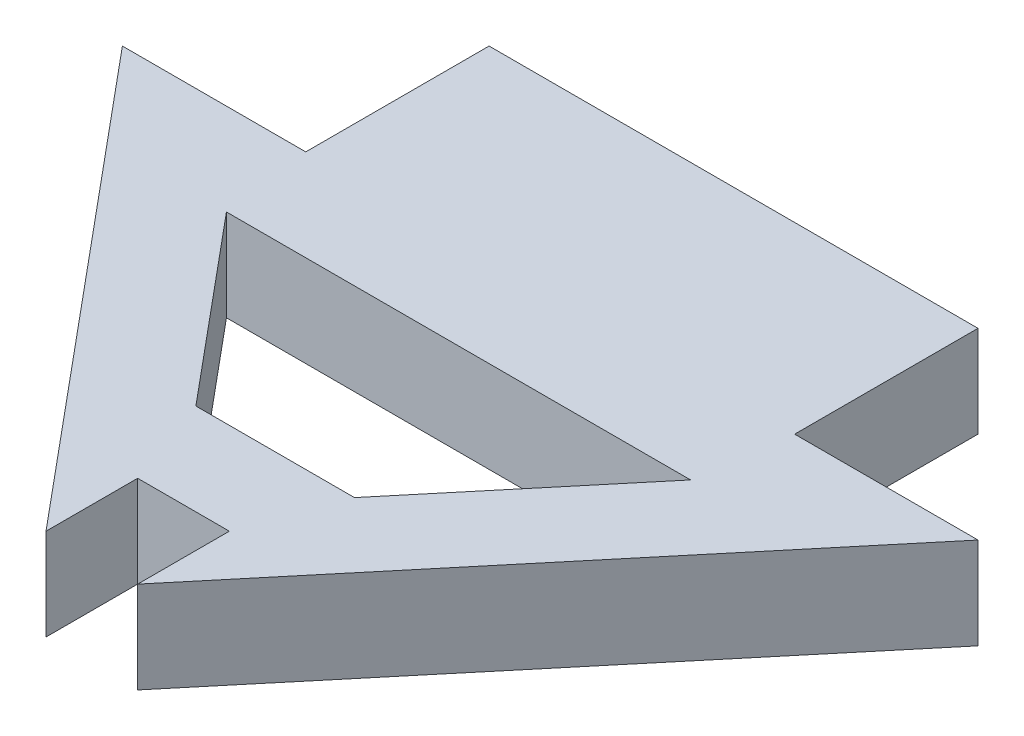
ISO-10303-21;
HEADER;
FILE_DESCRIPTION(('STEP AP214'),'2;1');
FILE_NAME('part.step','',(''),(''),'','','');
FILE_SCHEMA(('AUTOMOTIVE_DESIGN { 1 0 10303 214 1 1 1 1 }'));
ENDSEC;
DATA;
#1=APPLICATION_CONTEXT('core data for automotive mechanical design processes');
#2=APPLICATION_PROTOCOL_DEFINITION('international standard','automotive_design',2000,#1);
#3=PRODUCT_CONTEXT('',#1,'mechanical');
#4=PRODUCT('Part','Part','',(#3));
#5=PRODUCT_RELATED_PRODUCT_CATEGORY('part','',(#4));
#6=PRODUCT_DEFINITION_FORMATION('','',#4);
#7=PRODUCT_DEFINITION_CONTEXT('part definition',#1,'design');
#8=PRODUCT_DEFINITION('design','',#6,#7);
#9=PRODUCT_DEFINITION_SHAPE('','',#8);
#10=(LENGTH_UNIT() NAMED_UNIT(*) SI_UNIT(.MILLI.,.METRE.));
#11=(NAMED_UNIT(*) PLANE_ANGLE_UNIT() SI_UNIT($,.RADIAN.));
#12=(NAMED_UNIT(*) SI_UNIT($,.STERADIAN.) SOLID_ANGLE_UNIT());
#13=UNCERTAINTY_MEASURE_WITH_UNIT(LENGTH_MEASURE(1.E-05),#10,'distance_accuracy_value','');
#14=(GEOMETRIC_REPRESENTATION_CONTEXT(3) GLOBAL_UNCERTAINTY_ASSIGNED_CONTEXT((#13)) GLOBAL_UNIT_ASSIGNED_CONTEXT((#10,
#11,#12)) REPRESENTATION_CONTEXT('',''));
#15=CARTESIAN_POINT('',(0.,0.,0.));
#16=DIRECTION('',(0.,0.,1.));
#17=DIRECTION('',(1.,0.,0.));
#18=AXIS2_PLACEMENT_3D('',#15,#16,#17);
#19=CARTESIAN_POINT('',(0.,3.,0.));
#20=DIRECTION('',(0.,-1.,0.));
#21=DIRECTION('',(0.,0.,-1.));
#22=AXIS2_PLACEMENT_3D('',#19,#20,#21);
#23=PLANE('',#22);
#24=DIRECTION('',(0.64018439966448,0.,-0.768221279597376));
#25=VECTOR('',#24,1.);
#26=CARTESIAN_POINT('',(9.57948121573199,3.,11.9712742278367));
#27=LINE('',#26,#25);
#28=CARTESIAN_POINT('',(9.57948121573199,3.,11.9712742278367));
#29=VERTEX_POINT('',#28);
#30=CARTESIAN_POINT('',(22.079481215732,3.,-3.02872577216331));
#31=VERTEX_POINT('',#30);
#32=EDGE_CURVE('E170',#29,#31,#27,.T.);
#33=ORIENTED_EDGE('',*,*,#32,.T.);
#34=DIRECTION('',(-1.,0.,0.));
#35=VECTOR('',#34,1.);
#36=CARTESIAN_POINT('',(22.079481215732,3.,-3.02872577216331));
#37=LINE('',#36,#35);
#38=CARTESIAN_POINT('',(16.079481215732,3.,-3.02872577216331));
#39=VERTEX_POINT('',#38);
#40=EDGE_CURVE('E173',#31,#39,#37,.T.);
#41=ORIENTED_EDGE('',*,*,#40,.T.);
#42=DIRECTION('',(0.,0.,-1.));
#43=VECTOR('',#42,1.);
#44=CARTESIAN_POINT('',(16.079481215732,3.,-3.02872577216331));
#45=LINE('',#44,#43);
#46=CARTESIAN_POINT('',(16.079481215732,3.,-9.02872577216331));
#47=VERTEX_POINT('',#46);
#48=EDGE_CURVE('E176',#39,#47,#45,.T.);
#49=ORIENTED_EDGE('',*,*,#48,.T.);
#50=DIRECTION('',(-1.,0.,0.));
#51=VECTOR('',#50,1.);
#52=CARTESIAN_POINT('',(16.079481215732,3.,-9.02872577216331));
#53=LINE('',#52,#51);
#54=CARTESIAN_POINT('',(0.079481215731981,3.,-9.02872577216331));
#55=VERTEX_POINT('',#54);
#56=EDGE_CURVE('E178',#47,#55,#53,.T.);
#57=ORIENTED_EDGE('',*,*,#56,.T.);
#58=DIRECTION('',(0.,0.,1.));
#59=VECTOR('',#58,1.);
#60=CARTESIAN_POINT('',(0.079481215731981,3.,-9.02872577216331));
#61=LINE('',#60,#59);
#62=CARTESIAN_POINT('',(0.0794812157319848,3.,-3.02872577216331));
#63=VERTEX_POINT('',#62);
#64=EDGE_CURVE('E180',#55,#63,#61,.T.);
#65=ORIENTED_EDGE('',*,*,#64,.T.);
#66=DIRECTION('',(-1.,0.,0.));
#67=VECTOR('',#66,1.);
#68=CARTESIAN_POINT('',(0.0794812157319848,3.,-3.02872577216331));
#69=LINE('',#68,#67);
#70=CARTESIAN_POINT('',(-5.92051878426801,3.,-3.02872577216331));
#71=VERTEX_POINT('',#70);
#72=EDGE_CURVE('E182',#63,#71,#69,.T.);
#73=ORIENTED_EDGE('',*,*,#72,.T.);
#74=DIRECTION('',(0.64018439966448,0.,0.768221279597376));
#75=VECTOR('',#74,1.);
#76=CARTESIAN_POINT('',(-5.92051878426801,3.,-3.02872577216331));
#77=LINE('',#76,#75);
#78=CARTESIAN_POINT('',(6.57948121573198,3.,11.9712742278367));
#79=VERTEX_POINT('',#78);
#80=EDGE_CURVE('E184',#71,#79,#77,.T.);
#81=ORIENTED_EDGE('',*,*,#80,.T.);
#82=DIRECTION('',(0.,0.,-1.));
#83=VECTOR('',#82,1.);
#84=CARTESIAN_POINT('',(6.57948121573198,3.,11.9712742278367));
#85=LINE('',#84,#83);
#86=CARTESIAN_POINT('',(6.57948121573198,3.,8.97127422783669));
#87=VERTEX_POINT('',#86);
#88=EDGE_CURVE('E186',#79,#87,#85,.T.);
#89=ORIENTED_EDGE('',*,*,#88,.T.);
#90=DIRECTION('',(1.,0.,0.));
#91=VECTOR('',#90,1.);
#92=CARTESIAN_POINT('',(6.57948121573198,3.,8.97127422783669));
#93=LINE('',#92,#91);
#94=CARTESIAN_POINT('',(9.57948121573199,3.,8.97127422783669));
#95=VERTEX_POINT('',#94);
#96=EDGE_CURVE('E188',#87,#95,#93,.T.);
#97=ORIENTED_EDGE('',*,*,#96,.T.);
#98=DIRECTION('',(0.,0.,1.));
#99=VECTOR('',#98,1.);
#100=CARTESIAN_POINT('',(9.57948121573199,3.,8.97127422783669));
#101=LINE('',#100,#99);
#102=EDGE_CURVE('E190',#95,#29,#101,.T.);
#103=ORIENTED_EDGE('',*,*,#102,.T.);
#104=EDGE_LOOP('',(#33,#41,#49,#57,#65,#73,#81,#89,#97,#103));
#105=FACE_BOUND('',#104,.T.);
#106=DIRECTION('',(0.64018439966448,0.,-0.768221279597376));
#107=VECTOR('',#106,1.);
#108=CARTESIAN_POINT('',(10.6743563777787,3.,5.97127422783669));
#109=LINE('',#108,#107);
#110=CARTESIAN_POINT('',(10.6743563777787,3.,5.97127422783669));
#111=VERTEX_POINT('',#110);
#112=CARTESIAN_POINT('',(15.6743563777787,3.,-0.0287257721633136));
#113=VERTEX_POINT('',#112);
#114=EDGE_CURVE('E134',#111,#113,#109,.T.);
#115=ORIENTED_EDGE('',*,*,#114,.F.);
#116=DIRECTION('',(1.,0.,0.));
#117=VECTOR('',#116,1.);
#118=CARTESIAN_POINT('',(5.48460605368531,3.,5.97127422783669));
#119=LINE('',#118,#117);
#120=CARTESIAN_POINT('',(5.48460605368531,3.,5.97127422783669));
#121=VERTEX_POINT('',#120);
#122=EDGE_CURVE('E156',#121,#111,#119,.T.);
#123=ORIENTED_EDGE('',*,*,#122,.F.);
#124=DIRECTION('',(0.64018439966448,0.,0.768221279597376));
#125=VECTOR('',#124,1.);
#126=CARTESIAN_POINT('',(0.484606053685315,3.,-0.0287257721633119));
#127=LINE('',#126,#125);
#128=CARTESIAN_POINT('',(0.484606053685315,3.,-0.0287257721633119));
#129=VERTEX_POINT('',#128);
#130=EDGE_CURVE('E154',#129,#121,#127,.T.);
#131=ORIENTED_EDGE('',*,*,#130,.F.);
#132=DIRECTION('',(-1.,0.,0.));
#133=VECTOR('',#132,1.);
#134=CARTESIAN_POINT('',(15.6743563777787,3.,-0.0287257721633136));
#135=LINE('',#134,#133);
#136=EDGE_CURVE('E142',#113,#129,#135,.T.);
#137=ORIENTED_EDGE('',*,*,#136,.F.);
#138=EDGE_LOOP('',(#115,#123,#131,#137));
#139=FACE_BOUND('',#138,.T.);
#140=ADVANCED_FACE('F33',(#105,#139),#23,.F.);
#141=CARTESIAN_POINT('',(0.,0.,0.));
#142=DIRECTION('',(0.,-1.,0.));
#143=DIRECTION('',(0.,0.,-1.));
#144=AXIS2_PLACEMENT_3D('',#141,#142,#143);
#145=PLANE('',#144);
#146=DIRECTION('',(0.64018439966448,0.,-0.768221279597376));
#147=VECTOR('',#146,1.);
#148=CARTESIAN_POINT('',(9.57948121573199,0.,11.9712742278367));
#149=LINE('',#148,#147);
#150=CARTESIAN_POINT('',(9.57948121573199,0.,11.9712742278367));
#151=VERTEX_POINT('',#150);
#152=CARTESIAN_POINT('',(22.079481215732,0.,-3.02872577216331));
#153=VERTEX_POINT('',#152);
#154=EDGE_CURVE('E150',#151,#153,#149,.T.);
#155=ORIENTED_EDGE('',*,*,#154,.F.);
#156=DIRECTION('',(0.,0.,1.));
#157=VECTOR('',#156,1.);
#158=CARTESIAN_POINT('',(9.57948121573199,0.,8.97127422783669));
#159=LINE('',#158,#157);
#160=CARTESIAN_POINT('',(9.57948121573199,0.,8.97127422783669));
#161=VERTEX_POINT('',#160);
#162=EDGE_CURVE('E174',#161,#151,#159,.T.);
#163=ORIENTED_EDGE('',*,*,#162,.F.);
#164=DIRECTION('',(1.,0.,0.));
#165=VECTOR('',#164,1.);
#166=CARTESIAN_POINT('',(6.57948121573198,0.,8.97127422783669));
#167=LINE('',#166,#165);
#168=CARTESIAN_POINT('',(6.57948121573198,0.,8.97127422783669));
#169=VERTEX_POINT('',#168);
#170=EDGE_CURVE('E209',#169,#161,#167,.T.);
#171=ORIENTED_EDGE('',*,*,#170,.F.);
#172=DIRECTION('',(0.,0.,-1.));
#173=VECTOR('',#172,1.);
#174=CARTESIAN_POINT('',(6.57948121573198,0.,11.9712742278367));
#175=LINE('',#174,#173);
#176=CARTESIAN_POINT('',(6.57948121573198,0.,11.9712742278367));
#177=VERTEX_POINT('',#176);
#178=EDGE_CURVE('E207',#177,#169,#175,.T.);
#179=ORIENTED_EDGE('',*,*,#178,.F.);
#180=DIRECTION('',(0.64018439966448,0.,0.768221279597376));
#181=VECTOR('',#180,1.);
#182=CARTESIAN_POINT('',(-5.92051878426801,0.,-3.02872577216331));
#183=LINE('',#182,#181);
#184=CARTESIAN_POINT('',(-5.92051878426801,0.,-3.02872577216331));
#185=VERTEX_POINT('',#184);
#186=EDGE_CURVE('E205',#185,#177,#183,.T.);
#187=ORIENTED_EDGE('',*,*,#186,.F.);
#188=DIRECTION('',(-1.,0.,0.));
#189=VECTOR('',#188,1.);
#190=CARTESIAN_POINT('',(0.0794812157319848,0.,-3.02872577216331));
#191=LINE('',#190,#189);
#192=CARTESIAN_POINT('',(0.0794812157319848,0.,-3.02872577216331));
#193=VERTEX_POINT('',#192);
#194=EDGE_CURVE('E203',#193,#185,#191,.T.);
#195=ORIENTED_EDGE('',*,*,#194,.F.);
#196=DIRECTION('',(0.,0.,1.));
#197=VECTOR('',#196,1.);
#198=CARTESIAN_POINT('',(0.079481215731981,0.,-9.02872577216331));
#199=LINE('',#198,#197);
#200=CARTESIAN_POINT('',(0.079481215731981,0.,-9.02872577216331));
#201=VERTEX_POINT('',#200);
#202=EDGE_CURVE('E201',#201,#193,#199,.T.);
#203=ORIENTED_EDGE('',*,*,#202,.F.);
#204=DIRECTION('',(-1.,0.,0.));
#205=VECTOR('',#204,1.);
#206=CARTESIAN_POINT('',(16.079481215732,0.,-9.02872577216331));
#207=LINE('',#206,#205);
#208=CARTESIAN_POINT('',(16.079481215732,0.,-9.02872577216331));
#209=VERTEX_POINT('',#208);
#210=EDGE_CURVE('E199',#209,#201,#207,.T.);
#211=ORIENTED_EDGE('',*,*,#210,.F.);
#212=DIRECTION('',(0.,0.,-1.));
#213=VECTOR('',#212,1.);
#214=CARTESIAN_POINT('',(16.079481215732,0.,-3.02872577216331));
#215=LINE('',#214,#213);
#216=CARTESIAN_POINT('',(16.079481215732,0.,-3.02872577216331));
#217=VERTEX_POINT('',#216);
#218=EDGE_CURVE('E197',#217,#209,#215,.T.);
#219=ORIENTED_EDGE('',*,*,#218,.F.);
#220=DIRECTION('',(-1.,0.,0.));
#221=VECTOR('',#220,1.);
#222=CARTESIAN_POINT('',(22.079481215732,0.,-3.02872577216331));
#223=LINE('',#222,#221);
#224=EDGE_CURVE('E195',#153,#217,#223,.T.);
#225=ORIENTED_EDGE('',*,*,#224,.F.);
#226=EDGE_LOOP('',(#155,#163,#171,#179,#187,#195,#203,#211,#219,#225));
#227=FACE_BOUND('',#226,.T.);
#228=DIRECTION('',(1.,0.,0.));
#229=VECTOR('',#228,1.);
#230=CARTESIAN_POINT('',(5.48460605368531,0.,5.97127422783669));
#231=LINE('',#230,#229);
#232=CARTESIAN_POINT('',(5.48460605368531,0.,5.97127422783669));
#233=VERTEX_POINT('',#232);
#234=CARTESIAN_POINT('',(10.6743563777787,0.,5.97127422783669));
#235=VERTEX_POINT('',#234);
#236=EDGE_CURVE('E143',#233,#235,#231,.T.);
#237=ORIENTED_EDGE('',*,*,#236,.T.);
#238=DIRECTION('',(0.64018439966448,0.,-0.768221279597376));
#239=VECTOR('',#238,1.);
#240=CARTESIAN_POINT('',(10.6743563777787,0.,5.97127422783669));
#241=LINE('',#240,#239);
#242=CARTESIAN_POINT('',(15.6743563777787,0.,-0.0287257721633136));
#243=VERTEX_POINT('',#242);
#244=EDGE_CURVE('E56',#235,#243,#241,.T.);
#245=ORIENTED_EDGE('',*,*,#244,.T.);
#246=DIRECTION('',(-1.,0.,0.));
#247=VECTOR('',#246,1.);
#248=CARTESIAN_POINT('',(15.6743563777787,0.,-0.0287257721633136));
#249=LINE('',#248,#247);
#250=CARTESIAN_POINT('',(0.484606053685315,0.,-0.0287257721633119));
#251=VERTEX_POINT('',#250);
#252=EDGE_CURVE('E149',#243,#251,#249,.T.);
#253=ORIENTED_EDGE('',*,*,#252,.T.);
#254=DIRECTION('',(0.64018439966448,0.,0.768221279597376));
#255=VECTOR('',#254,1.);
#256=CARTESIAN_POINT('',(0.484606053685315,0.,-0.0287257721633119));
#257=LINE('',#256,#255);
#258=EDGE_CURVE('E162',#251,#233,#257,.T.);
#259=ORIENTED_EDGE('',*,*,#258,.T.);
#260=EDGE_LOOP('',(#237,#245,#253,#259));
#261=FACE_BOUND('',#260,.T.);
#262=ADVANCED_FACE('F245',(#227,#261),#145,.T.);
#263=CARTESIAN_POINT('',(9.57948121573199,3.,11.9712742278367));
#264=DIRECTION('',(-0.768221279597376,0.,-0.64018439966448));
#265=DIRECTION('',(-0.64018439966448,0.,0.768221279597376));
#266=AXIS2_PLACEMENT_3D('',#263,#264,#265);
#267=PLANE('',#266);
#268=ORIENTED_EDGE('',*,*,#154,.T.);
#269=DIRECTION('',(0.,-1.,0.));
#270=VECTOR('',#269,1.);
#271=CARTESIAN_POINT('',(22.079481215732,3.,-3.02872577216331));
#272=LINE('',#271,#270);
#273=EDGE_CURVE('E11',#31,#153,#272,.T.);
#274=ORIENTED_EDGE('',*,*,#273,.F.);
#275=ORIENTED_EDGE('',*,*,#32,.F.);
#276=DIRECTION('',(0.,-1.,0.));
#277=VECTOR('',#276,1.);
#278=CARTESIAN_POINT('',(9.57948121573199,3.,11.9712742278367));
#279=LINE('',#278,#277);
#280=EDGE_CURVE('E192',#29,#151,#279,.T.);
#281=ORIENTED_EDGE('',*,*,#280,.T.);
#282=EDGE_LOOP('',(#268,#274,#275,#281));
#283=FACE_BOUND('',#282,.T.);
#284=ADVANCED_FACE('F35',(#283),#267,.F.);
#285=CARTESIAN_POINT('',(22.079481215732,3.,-3.02872577216331));
#286=DIRECTION('',(0.,0.,1.));
#287=DIRECTION('',(1.,0.,0.));
#288=AXIS2_PLACEMENT_3D('',#285,#286,#287);
#289=PLANE('',#288);
#290=ORIENTED_EDGE('',*,*,#224,.T.);
#291=DIRECTION('',(0.,-1.,0.));
#292=VECTOR('',#291,1.);
#293=CARTESIAN_POINT('',(16.079481215732,3.,-3.02872577216331));
#294=LINE('',#293,#292);
#295=EDGE_CURVE('E41',#39,#217,#294,.T.);
#296=ORIENTED_EDGE('',*,*,#295,.F.);
#297=ORIENTED_EDGE('',*,*,#40,.F.);
#298=ORIENTED_EDGE('',*,*,#273,.T.);
#299=EDGE_LOOP('',(#290,#296,#297,#298));
#300=FACE_BOUND('',#299,.T.);
#301=ADVANCED_FACE('F262',(#300),#289,.F.);
#302=CARTESIAN_POINT('',(16.079481215732,3.,-3.02872577216331));
#303=DIRECTION('',(-1.,0.,0.));
#304=DIRECTION('',(0.,0.,1.));
#305=AXIS2_PLACEMENT_3D('',#302,#303,#304);
#306=PLANE('',#305);
#307=ORIENTED_EDGE('',*,*,#218,.T.);
#308=DIRECTION('',(0.,-1.,0.));
#309=VECTOR('',#308,1.);
#310=CARTESIAN_POINT('',(16.079481215732,3.,-9.02872577216331));
#311=LINE('',#310,#309);
#312=EDGE_CURVE('E232',#47,#209,#311,.T.);
#313=ORIENTED_EDGE('',*,*,#312,.F.);
#314=ORIENTED_EDGE('',*,*,#48,.F.);
#315=ORIENTED_EDGE('',*,*,#295,.T.);
#316=EDGE_LOOP('',(#307,#313,#314,#315));
#317=FACE_BOUND('',#316,.T.);
#318=ADVANCED_FACE('F239',(#317),#306,.F.);
#319=CARTESIAN_POINT('',(16.079481215732,3.,-9.02872577216331));
#320=DIRECTION('',(0.,0.,1.));
#321=DIRECTION('',(1.,0.,0.));
#322=AXIS2_PLACEMENT_3D('',#319,#320,#321);
#323=PLANE('',#322);
#324=ORIENTED_EDGE('',*,*,#210,.T.);
#325=DIRECTION('',(0.,-1.,0.));
#326=VECTOR('',#325,1.);
#327=CARTESIAN_POINT('',(0.079481215731981,3.,-9.02872577216331));
#328=LINE('',#327,#326);
#329=EDGE_CURVE('E229',#55,#201,#328,.T.);
#330=ORIENTED_EDGE('',*,*,#329,.F.);
#331=ORIENTED_EDGE('',*,*,#56,.F.);
#332=ORIENTED_EDGE('',*,*,#312,.T.);
#333=EDGE_LOOP('',(#324,#330,#331,#332));
#334=FACE_BOUND('',#333,.T.);
#335=ADVANCED_FACE('F251',(#334),#323,.F.);
#336=CARTESIAN_POINT('',(0.079481215731981,3.,-9.02872577216331));
#337=DIRECTION('',(1.,0.,0.));
#338=DIRECTION('',(0.,0.,-1.));
#339=AXIS2_PLACEMENT_3D('',#336,#337,#338);
#340=PLANE('',#339);
#341=ORIENTED_EDGE('',*,*,#202,.T.);
#342=DIRECTION('',(0.,-1.,0.));
#343=VECTOR('',#342,1.);
#344=CARTESIAN_POINT('',(0.0794812157319848,3.,-3.02872577216331));
#345=LINE('',#344,#343);
#346=EDGE_CURVE('E226',#63,#193,#345,.T.);
#347=ORIENTED_EDGE('',*,*,#346,.F.);
#348=ORIENTED_EDGE('',*,*,#64,.F.);
#349=ORIENTED_EDGE('',*,*,#329,.T.);
#350=EDGE_LOOP('',(#341,#347,#348,#349));
#351=FACE_BOUND('',#350,.T.);
#352=ADVANCED_FACE('F255',(#351),#340,.F.);
#353=CARTESIAN_POINT('',(0.0794812157319848,3.,-3.02872577216331));
#354=DIRECTION('',(0.,0.,1.));
#355=DIRECTION('',(1.,0.,0.));
#356=AXIS2_PLACEMENT_3D('',#353,#354,#355);
#357=PLANE('',#356);
#358=ORIENTED_EDGE('',*,*,#194,.T.);
#359=DIRECTION('',(0.,-1.,0.));
#360=VECTOR('',#359,1.);
#361=CARTESIAN_POINT('',(-5.92051878426801,3.,-3.02872577216331));
#362=LINE('',#361,#360);
#363=EDGE_CURVE('E223',#71,#185,#362,.T.);
#364=ORIENTED_EDGE('',*,*,#363,.F.);
#365=ORIENTED_EDGE('',*,*,#72,.F.);
#366=ORIENTED_EDGE('',*,*,#346,.T.);
#367=EDGE_LOOP('',(#358,#364,#365,#366));
#368=FACE_BOUND('',#367,.T.);
#369=ADVANCED_FACE('F285',(#368),#357,.F.);
#370=CARTESIAN_POINT('',(-5.92051878426801,3.,-3.02872577216331));
#371=DIRECTION('',(0.768221279597376,0.,-0.64018439966448));
#372=DIRECTION('',(-0.64018439966448,0.,-0.768221279597376));
#373=AXIS2_PLACEMENT_3D('',#370,#371,#372);
#374=PLANE('',#373);
#375=ORIENTED_EDGE('',*,*,#186,.T.);
#376=DIRECTION('',(0.,-1.,0.));
#377=VECTOR('',#376,1.);
#378=CARTESIAN_POINT('',(6.57948121573198,3.,11.9712742278367));
#379=LINE('',#378,#377);
#380=EDGE_CURVE('E220',#79,#177,#379,.T.);
#381=ORIENTED_EDGE('',*,*,#380,.F.);
#382=ORIENTED_EDGE('',*,*,#80,.F.);
#383=ORIENTED_EDGE('',*,*,#363,.T.);
#384=EDGE_LOOP('',(#375,#381,#382,#383));
#385=FACE_BOUND('',#384,.T.);
#386=ADVANCED_FACE('F282',(#385),#374,.F.);
#387=CARTESIAN_POINT('',(6.57948121573198,3.,11.9712742278367));
#388=DIRECTION('',(-1.,0.,0.));
#389=DIRECTION('',(0.,0.,1.));
#390=AXIS2_PLACEMENT_3D('',#387,#388,#389);
#391=PLANE('',#390);
#392=ORIENTED_EDGE('',*,*,#178,.T.);
#393=DIRECTION('',(0.,-1.,0.));
#394=VECTOR('',#393,1.);
#395=CARTESIAN_POINT('',(6.57948121573198,3.,8.97127422783669));
#396=LINE('',#395,#394);
#397=EDGE_CURVE('E217',#87,#169,#396,.T.);
#398=ORIENTED_EDGE('',*,*,#397,.F.);
#399=ORIENTED_EDGE('',*,*,#88,.F.);
#400=ORIENTED_EDGE('',*,*,#380,.T.);
#401=EDGE_LOOP('',(#392,#398,#399,#400));
#402=FACE_BOUND('',#401,.T.);
#403=ADVANCED_FACE('F278',(#402),#391,.F.);
#404=CARTESIAN_POINT('',(6.57948121573198,3.,8.97127422783669));
#405=DIRECTION('',(0.,0.,-1.));
#406=DIRECTION('',(-1.,0.,0.));
#407=AXIS2_PLACEMENT_3D('',#404,#405,#406);
#408=PLANE('',#407);
#409=ORIENTED_EDGE('',*,*,#170,.T.);
#410=DIRECTION('',(0.,-1.,0.));
#411=VECTOR('',#410,1.);
#412=CARTESIAN_POINT('',(9.57948121573199,3.,8.97127422783669));
#413=LINE('',#412,#411);
#414=EDGE_CURVE('E214',#95,#161,#413,.T.);
#415=ORIENTED_EDGE('',*,*,#414,.F.);
#416=ORIENTED_EDGE('',*,*,#96,.F.);
#417=ORIENTED_EDGE('',*,*,#397,.T.);
#418=EDGE_LOOP('',(#409,#415,#416,#417));
#419=FACE_BOUND('',#418,.T.);
#420=ADVANCED_FACE('F274',(#419),#408,.F.);
#421=CARTESIAN_POINT('',(9.57948121573199,3.,8.97127422783669));
#422=DIRECTION('',(1.,0.,0.));
#423=DIRECTION('',(0.,0.,-1.));
#424=AXIS2_PLACEMENT_3D('',#421,#422,#423);
#425=PLANE('',#424);
#426=ORIENTED_EDGE('',*,*,#162,.T.);
#427=ORIENTED_EDGE('',*,*,#280,.F.);
#428=ORIENTED_EDGE('',*,*,#102,.F.);
#429=ORIENTED_EDGE('',*,*,#414,.T.);
#430=EDGE_LOOP('',(#426,#427,#428,#429));
#431=FACE_BOUND('',#430,.T.);
#432=ADVANCED_FACE('F269',(#431),#425,.F.);
#433=CARTESIAN_POINT('',(10.6743563777787,3.,5.97127422783669));
#434=DIRECTION('',(-0.768221279597376,0.,-0.64018439966448));
#435=DIRECTION('',(-0.64018439966448,0.,0.768221279597376));
#436=AXIS2_PLACEMENT_3D('',#433,#434,#435);
#437=PLANE('',#436);
#438=ORIENTED_EDGE('',*,*,#244,.F.);
#439=DIRECTION('',(0.,-1.,0.));
#440=VECTOR('',#439,1.);
#441=CARTESIAN_POINT('',(10.6743563777787,3.,5.97127422783669));
#442=LINE('',#441,#440);
#443=EDGE_CURVE('E138',#111,#235,#442,.T.);
#444=ORIENTED_EDGE('',*,*,#443,.F.);
#445=ORIENTED_EDGE('',*,*,#114,.T.);
#446=DIRECTION('',(0.,-1.,0.));
#447=VECTOR('',#446,1.);
#448=CARTESIAN_POINT('',(15.6743563777787,3.,-0.0287257721633136));
#449=LINE('',#448,#447);
#450=EDGE_CURVE('E137',#113,#243,#449,.T.);
#451=ORIENTED_EDGE('',*,*,#450,.T.);
#452=EDGE_LOOP('',(#438,#444,#445,#451));
#453=FACE_BOUND('',#452,.T.);
#454=ADVANCED_FACE('F136',(#453),#437,.T.);
#455=CARTESIAN_POINT('',(15.6743563777787,3.,-0.0287257721633136));
#456=DIRECTION('',(0.,0.,1.));
#457=DIRECTION('',(1.,0.,0.));
#458=AXIS2_PLACEMENT_3D('',#455,#456,#457);
#459=PLANE('',#458);
#460=ORIENTED_EDGE('',*,*,#252,.F.);
#461=ORIENTED_EDGE('',*,*,#450,.F.);
#462=ORIENTED_EDGE('',*,*,#136,.T.);
#463=DIRECTION('',(0.,-1.,0.));
#464=VECTOR('',#463,1.);
#465=CARTESIAN_POINT('',(0.484606053685315,3.,-0.0287257721633119));
#466=LINE('',#465,#464);
#467=EDGE_CURVE('E151',#129,#251,#466,.T.);
#468=ORIENTED_EDGE('',*,*,#467,.T.);
#469=EDGE_LOOP('',(#460,#461,#462,#468));
#470=FACE_BOUND('',#469,.T.);
#471=ADVANCED_FACE('F146',(#470),#459,.T.);
#472=CARTESIAN_POINT('',(0.484606053685315,3.,-0.0287257721633119));
#473=DIRECTION('',(0.768221279597376,0.,-0.64018439966448));
#474=DIRECTION('',(-0.64018439966448,0.,-0.768221279597376));
#475=AXIS2_PLACEMENT_3D('',#472,#473,#474);
#476=PLANE('',#475);
#477=ORIENTED_EDGE('',*,*,#258,.F.);
#478=ORIENTED_EDGE('',*,*,#467,.F.);
#479=ORIENTED_EDGE('',*,*,#130,.T.);
#480=DIRECTION('',(0.,-1.,0.));
#481=VECTOR('',#480,1.);
#482=CARTESIAN_POINT('',(5.48460605368531,3.,5.97127422783669));
#483=LINE('',#482,#481);
#484=EDGE_CURVE('E48',#121,#233,#483,.T.);
#485=ORIENTED_EDGE('',*,*,#484,.T.);
#486=EDGE_LOOP('',(#477,#478,#479,#485));
#487=FACE_BOUND('',#486,.T.);
#488=ADVANCED_FACE('F331',(#487),#476,.T.);
#489=CARTESIAN_POINT('',(5.48460605368531,3.,5.97127422783669));
#490=DIRECTION('',(0.,0.,-1.));
#491=DIRECTION('',(-1.,0.,0.));
#492=AXIS2_PLACEMENT_3D('',#489,#490,#491);
#493=PLANE('',#492);
#494=ORIENTED_EDGE('',*,*,#236,.F.);
#495=ORIENTED_EDGE('',*,*,#484,.F.);
#496=ORIENTED_EDGE('',*,*,#122,.T.);
#497=ORIENTED_EDGE('',*,*,#443,.T.);
#498=EDGE_LOOP('',(#494,#495,#496,#497));
#499=FACE_BOUND('',#498,.T.);
#500=ADVANCED_FACE('F337',(#499),#493,.T.);
#501=CLOSED_SHELL('',(#140,#262,#284,#301,#318,#335,#352,#369,#386,#403,#420,#432,#454,#471,
#488,#500));
#502=MANIFOLD_SOLID_BREP('B2',#501);
#503=ADVANCED_BREP_SHAPE_REPRESENTATION('',(#18,#502),#14);
#504=SHAPE_DEFINITION_REPRESENTATION(#9,#503);
ENDSEC;
END-ISO-10303-21;
